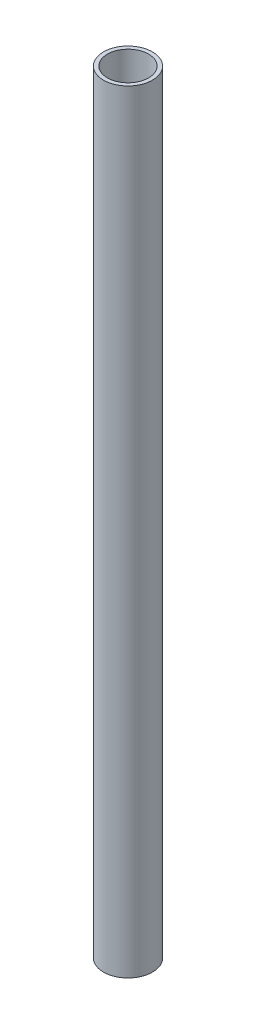
ISO-10303-21;
HEADER;
FILE_DESCRIPTION(('STEP AP214'),'2;1');
FILE_NAME('part.step','',(''),(''),'','','');
FILE_SCHEMA(('AUTOMOTIVE_DESIGN { 1 0 10303 214 1 1 1 1 }'));
ENDSEC;
DATA;
#1=APPLICATION_CONTEXT('core data for automotive mechanical design processes');
#2=APPLICATION_PROTOCOL_DEFINITION('international standard','automotive_design',2000,#1);
#3=PRODUCT_CONTEXT('',#1,'mechanical');
#4=PRODUCT('Part','Part','',(#3));
#5=PRODUCT_RELATED_PRODUCT_CATEGORY('part','',(#4));
#6=PRODUCT_DEFINITION_FORMATION('','',#4);
#7=PRODUCT_DEFINITION_CONTEXT('part definition',#1,'design');
#8=PRODUCT_DEFINITION('design','',#6,#7);
#9=PRODUCT_DEFINITION_SHAPE('','',#8);
#10=(LENGTH_UNIT() NAMED_UNIT(*) SI_UNIT(.MILLI.,.METRE.));
#11=(NAMED_UNIT(*) PLANE_ANGLE_UNIT() SI_UNIT($,.RADIAN.));
#12=(NAMED_UNIT(*) SI_UNIT($,.STERADIAN.) SOLID_ANGLE_UNIT());
#13=UNCERTAINTY_MEASURE_WITH_UNIT(LENGTH_MEASURE(1.E-05),#10,'distance_accuracy_value','');
#14=(GEOMETRIC_REPRESENTATION_CONTEXT(3) GLOBAL_UNCERTAINTY_ASSIGNED_CONTEXT((#13)) GLOBAL_UNIT_ASSIGNED_CONTEXT((#10,
#11,#12)) REPRESENTATION_CONTEXT('',''));
#15=CARTESIAN_POINT('',(0.,0.,0.));
#16=DIRECTION('',(0.,0.,1.));
#17=DIRECTION('',(1.,0.,0.));
#18=AXIS2_PLACEMENT_3D('',#15,#16,#17);
#19=CARTESIAN_POINT('',(0.,761.0475,0.));
#20=DIRECTION('',(0.,1.,0.));
#21=DIRECTION('',(0.,0.,1.));
#22=AXIS2_PLACEMENT_3D('',#19,#20,#21);
#23=PLANE('',#22);
#24=CARTESIAN_POINT('',(0.,761.0475,0.));
#25=DIRECTION('',(0.,1.,0.));
#26=DIRECTION('',(0.,0.,1.));
#27=AXIS2_PLACEMENT_3D('',#24,#25,#26);
#28=CIRCLE('',#27,24.13);
#29=CARTESIAN_POINT('',(0.,761.0475,24.13));
#30=VERTEX_POINT('',#29);
#31=EDGE_CURVE('E10',#30,#30,#28,.T.);
#32=ORIENTED_EDGE('',*,*,#31,.T.);
#33=EDGE_LOOP('',(#32));
#34=FACE_BOUND('',#33,.T.);
#35=CARTESIAN_POINT('',(0.,761.0475,0.));
#36=DIRECTION('',(0.,1.,0.));
#37=DIRECTION('',(0.,0.,1.));
#38=AXIS2_PLACEMENT_3D('',#35,#36,#37);
#39=CIRCLE('',#38,20.32);
#40=CARTESIAN_POINT('',(0.,761.0475,20.32));
#41=VERTEX_POINT('',#40);
#42=EDGE_CURVE('E50',#41,#41,#39,.T.);
#43=ORIENTED_EDGE('',*,*,#42,.F.);
#44=EDGE_LOOP('',(#43));
#45=FACE_BOUND('',#44,.T.);
#46=ADVANCED_FACE('F37',(#34,#45),#23,.T.);
#47=CARTESIAN_POINT('',(0.,0.,0.));
#48=DIRECTION('',(0.,1.,0.));
#49=DIRECTION('',(0.,0.,1.));
#50=AXIS2_PLACEMENT_3D('',#47,#48,#49);
#51=PLANE('',#50);
#52=CARTESIAN_POINT('',(0.,0.,0.));
#53=DIRECTION('',(0.,1.,0.));
#54=DIRECTION('',(0.,0.,1.));
#55=AXIS2_PLACEMENT_3D('',#52,#53,#54);
#56=CIRCLE('',#55,24.13);
#57=CARTESIAN_POINT('',(0.,0.,24.13));
#58=VERTEX_POINT('',#57);
#59=EDGE_CURVE('E41',#58,#58,#56,.T.);
#60=ORIENTED_EDGE('',*,*,#59,.F.);
#61=EDGE_LOOP('',(#60));
#62=FACE_BOUND('',#61,.T.);
#63=CARTESIAN_POINT('',(0.,0.,0.));
#64=DIRECTION('',(0.,1.,0.));
#65=DIRECTION('',(0.,0.,1.));
#66=AXIS2_PLACEMENT_3D('',#63,#64,#65);
#67=CIRCLE('',#66,20.32);
#68=CARTESIAN_POINT('',(0.,0.,20.32));
#69=VERTEX_POINT('',#68);
#70=EDGE_CURVE('E52',#69,#69,#67,.T.);
#71=ORIENTED_EDGE('',*,*,#70,.T.);
#72=EDGE_LOOP('',(#71));
#73=FACE_BOUND('',#72,.T.);
#74=ADVANCED_FACE('F64',(#62,#73),#51,.F.);
#75=CARTESIAN_POINT('',(0.,761.0475,0.));
#76=DIRECTION('',(0.,-1.,0.));
#77=DIRECTION('',(0.,0.,-1.));
#78=AXIS2_PLACEMENT_3D('',#75,#76,#77);
#79=CYLINDRICAL_SURFACE('',#78,24.13);
#80=ORIENTED_EDGE('',*,*,#31,.F.);
#81=EDGE_LOOP('',(#80));
#82=FACE_BOUND('',#81,.T.);
#83=ORIENTED_EDGE('',*,*,#59,.T.);
#84=EDGE_LOOP('',(#83));
#85=FACE_BOUND('',#84,.T.);
#86=ADVANCED_FACE('F39',(#82,#85),#79,.T.);
#87=CARTESIAN_POINT('',(0.,761.0475,0.));
#88=DIRECTION('',(0.,-1.,0.));
#89=DIRECTION('',(0.,0.,-1.));
#90=AXIS2_PLACEMENT_3D('',#87,#88,#89);
#91=CYLINDRICAL_SURFACE('',#90,20.32);
#92=ORIENTED_EDGE('',*,*,#42,.T.);
#93=EDGE_LOOP('',(#92));
#94=FACE_BOUND('',#93,.T.);
#95=ORIENTED_EDGE('',*,*,#70,.F.);
#96=EDGE_LOOP('',(#95));
#97=FACE_BOUND('',#96,.T.);
#98=ADVANCED_FACE('F60',(#94,#97),#91,.F.);
#99=CLOSED_SHELL('',(#46,#74,#86,#98));
#100=MANIFOLD_SOLID_BREP('B2',#99);
#101=ADVANCED_BREP_SHAPE_REPRESENTATION('',(#18,#100),#14);
#102=SHAPE_DEFINITION_REPRESENTATION(#9,#101);
ENDSEC;
END-ISO-10303-21;
